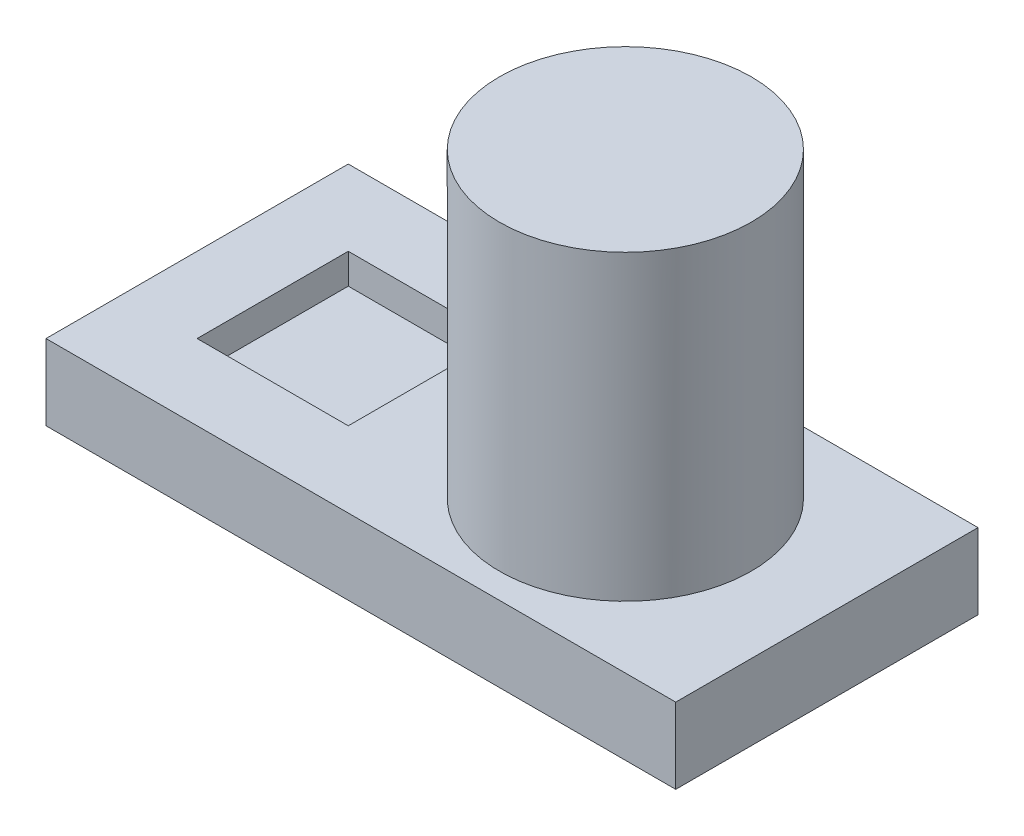
ISO-10303-21;
HEADER;
FILE_DESCRIPTION(('STEP AP214'),'2;1');
FILE_NAME('part.step','',(''),(''),'','','');
FILE_SCHEMA(('AUTOMOTIVE_DESIGN { 1 0 10303 214 1 1 1 1 }'));
ENDSEC;
DATA;
#1=APPLICATION_CONTEXT('core data for automotive mechanical design processes');
#2=APPLICATION_PROTOCOL_DEFINITION('international standard','automotive_design',2000,#1);
#3=PRODUCT_CONTEXT('',#1,'mechanical');
#4=PRODUCT('Part','Part','',(#3));
#5=PRODUCT_RELATED_PRODUCT_CATEGORY('part','',(#4));
#6=PRODUCT_DEFINITION_FORMATION('','',#4);
#7=PRODUCT_DEFINITION_CONTEXT('part definition',#1,'design');
#8=PRODUCT_DEFINITION('design','',#6,#7);
#9=PRODUCT_DEFINITION_SHAPE('','',#8);
#10=(LENGTH_UNIT() NAMED_UNIT(*) SI_UNIT(.MILLI.,.METRE.));
#11=(NAMED_UNIT(*) PLANE_ANGLE_UNIT() SI_UNIT($,.RADIAN.));
#12=(NAMED_UNIT(*) SI_UNIT($,.STERADIAN.) SOLID_ANGLE_UNIT());
#13=UNCERTAINTY_MEASURE_WITH_UNIT(LENGTH_MEASURE(1.E-05),#10,'distance_accuracy_value','');
#14=(GEOMETRIC_REPRESENTATION_CONTEXT(3) GLOBAL_UNCERTAINTY_ASSIGNED_CONTEXT((#13)) GLOBAL_UNIT_ASSIGNED_CONTEXT((#10,
#11,#12)) REPRESENTATION_CONTEXT('',''));
#15=CARTESIAN_POINT('',(0.,0.,0.));
#16=DIRECTION('',(0.,0.,1.));
#17=DIRECTION('',(1.,0.,0.));
#18=AXIS2_PLACEMENT_3D('',#15,#16,#17);
#19=CARTESIAN_POINT('',(0.,15.,-60.));
#20=DIRECTION('',(0.,-1.,0.));
#21=DIRECTION('',(0.,0.,-1.));
#22=AXIS2_PLACEMENT_3D('',#19,#20,#21);
#23=PLANE('',#22);
#24=DIRECTION('',(0.,0.,-1.));
#25=VECTOR('',#24,1.);
#26=CARTESIAN_POINT('',(45.,15.,-45.));
#27=LINE('',#26,#25);
#28=CARTESIAN_POINT('',(45.,15.,-15.));
#29=VERTEX_POINT('',#28);
#30=CARTESIAN_POINT('',(45.,15.,-45.));
#31=VERTEX_POINT('',#30);
#32=EDGE_CURVE('E111',#29,#31,#27,.T.);
#33=ORIENTED_EDGE('',*,*,#32,.F.);
#34=DIRECTION('',(1.,0.,0.));
#35=VECTOR('',#34,1.);
#36=CARTESIAN_POINT('',(15.,15.,-15.));
#37=LINE('',#36,#35);
#38=CARTESIAN_POINT('',(15.,15.,-15.));
#39=VERTEX_POINT('',#38);
#40=EDGE_CURVE('E45',#39,#29,#37,.T.);
#41=ORIENTED_EDGE('',*,*,#40,.F.);
#42=DIRECTION('',(0.,0.,1.));
#43=VECTOR('',#42,1.);
#44=CARTESIAN_POINT('',(15.,15.,-45.));
#45=LINE('',#44,#43);
#46=CARTESIAN_POINT('',(15.,15.,-45.));
#47=VERTEX_POINT('',#46);
#48=EDGE_CURVE('E116',#47,#39,#45,.T.);
#49=ORIENTED_EDGE('',*,*,#48,.F.);
#50=DIRECTION('',(-1.,0.,0.));
#51=VECTOR('',#50,1.);
#52=CARTESIAN_POINT('',(15.,15.,-45.));
#53=LINE('',#52,#51);
#54=EDGE_CURVE('E100',#31,#47,#53,.T.);
#55=ORIENTED_EDGE('',*,*,#54,.F.);
#56=EDGE_LOOP('',(#33,#41,#49,#55));
#57=FACE_BOUND('',#56,.T.);
#58=DIRECTION('',(0.,0.,1.));
#59=VECTOR('',#58,1.);
#60=CARTESIAN_POINT('',(0.,15.,0.));
#61=LINE('',#60,#59);
#62=CARTESIAN_POINT('',(0.,15.,-60.));
#63=VERTEX_POINT('',#62);
#64=CARTESIAN_POINT('',(0.,15.,0.));
#65=VERTEX_POINT('',#64);
#66=EDGE_CURVE('E146',#63,#65,#61,.T.);
#67=ORIENTED_EDGE('',*,*,#66,.T.);
#68=DIRECTION('',(1.,0.,0.));
#69=VECTOR('',#68,1.);
#70=CARTESIAN_POINT('',(0.,15.,0.));
#71=LINE('',#70,#69);
#72=CARTESIAN_POINT('',(125.,15.,0.));
#73=VERTEX_POINT('',#72);
#74=EDGE_CURVE('E148',#65,#73,#71,.T.);
#75=ORIENTED_EDGE('',*,*,#74,.T.);
#76=DIRECTION('',(0.,0.,-1.));
#77=VECTOR('',#76,1.);
#78=CARTESIAN_POINT('',(125.,15.,0.));
#79=LINE('',#78,#77);
#80=CARTESIAN_POINT('',(125.,15.,-60.));
#81=VERTEX_POINT('',#80);
#82=EDGE_CURVE('E150',#73,#81,#79,.T.);
#83=ORIENTED_EDGE('',*,*,#82,.T.);
#84=DIRECTION('',(-1.,0.,0.));
#85=VECTOR('',#84,1.);
#86=CARTESIAN_POINT('',(0.,15.,-60.));
#87=LINE('',#86,#85);
#88=EDGE_CURVE('E53',#81,#63,#87,.T.);
#89=ORIENTED_EDGE('',*,*,#88,.T.);
#90=EDGE_LOOP('',(#67,#75,#83,#89));
#91=FACE_BOUND('',#90,.T.);
#92=CARTESIAN_POINT('',(85.,15.,-30.));
#93=DIRECTION('',(0.,-1.,0.));
#94=DIRECTION('',(0.,0.,-1.));
#95=AXIS2_PLACEMENT_3D('',#92,#93,#94);
#96=CIRCLE('',#95,25.);
#97=CARTESIAN_POINT('',(85.,15.,-55.));
#98=VERTEX_POINT('',#97);
#99=EDGE_CURVE('E11',#98,#98,#96,.F.);
#100=ORIENTED_EDGE('',*,*,#99,.F.);
#101=EDGE_LOOP('',(#100));
#102=FACE_BOUND('',#101,.T.);
#103=ADVANCED_FACE('F30',(#57,#91,#102),#23,.F.);
#104=CARTESIAN_POINT('',(0.,15.,0.));
#105=DIRECTION('',(1.,0.,0.));
#106=DIRECTION('',(0.,0.,-1.));
#107=AXIS2_PLACEMENT_3D('',#104,#105,#106);
#108=PLANE('',#107);
#109=DIRECTION('',(0.,0.,1.));
#110=VECTOR('',#109,1.);
#111=CARTESIAN_POINT('',(0.,0.,0.));
#112=LINE('',#111,#110);
#113=CARTESIAN_POINT('',(0.,0.,-60.));
#114=VERTEX_POINT('',#113);
#115=CARTESIAN_POINT('',(0.,0.,0.));
#116=VERTEX_POINT('',#115);
#117=EDGE_CURVE('E137',#114,#116,#112,.T.);
#118=ORIENTED_EDGE('',*,*,#117,.T.);
#119=DIRECTION('',(0.,-1.,0.));
#120=VECTOR('',#119,1.);
#121=CARTESIAN_POINT('',(0.,15.,0.));
#122=LINE('',#121,#120);
#123=EDGE_CURVE('E38',#65,#116,#122,.T.);
#124=ORIENTED_EDGE('',*,*,#123,.F.);
#125=ORIENTED_EDGE('',*,*,#66,.F.);
#126=DIRECTION('',(0.,-1.,0.));
#127=VECTOR('',#126,1.);
#128=CARTESIAN_POINT('',(0.,15.,-60.));
#129=LINE('',#128,#127);
#130=EDGE_CURVE('E153',#63,#114,#129,.T.);
#131=ORIENTED_EDGE('',*,*,#130,.T.);
#132=EDGE_LOOP('',(#118,#124,#125,#131));
#133=FACE_BOUND('',#132,.T.);
#134=ADVANCED_FACE('F32',(#133),#108,.F.);
#135=CARTESIAN_POINT('',(0.,15.,0.));
#136=DIRECTION('',(0.,0.,-1.));
#137=DIRECTION('',(-1.,0.,0.));
#138=AXIS2_PLACEMENT_3D('',#135,#136,#137);
#139=PLANE('',#138);
#140=DIRECTION('',(1.,0.,0.));
#141=VECTOR('',#140,1.);
#142=CARTESIAN_POINT('',(0.,0.,0.));
#143=LINE('',#142,#141);
#144=CARTESIAN_POINT('',(125.,0.,0.));
#145=VERTEX_POINT('',#144);
#146=EDGE_CURVE('E140',#116,#145,#143,.T.);
#147=ORIENTED_EDGE('',*,*,#146,.T.);
#148=DIRECTION('',(0.,-1.,0.));
#149=VECTOR('',#148,1.);
#150=CARTESIAN_POINT('',(125.,15.,0.));
#151=LINE('',#150,#149);
#152=EDGE_CURVE('E159',#73,#145,#151,.T.);
#153=ORIENTED_EDGE('',*,*,#152,.F.);
#154=ORIENTED_EDGE('',*,*,#74,.F.);
#155=ORIENTED_EDGE('',*,*,#123,.T.);
#156=EDGE_LOOP('',(#147,#153,#154,#155));
#157=FACE_BOUND('',#156,.T.);
#158=ADVANCED_FACE('F164',(#157),#139,.F.);
#159=CARTESIAN_POINT('',(125.,15.,0.));
#160=DIRECTION('',(-1.,0.,0.));
#161=DIRECTION('',(0.,0.,1.));
#162=AXIS2_PLACEMENT_3D('',#159,#160,#161);
#163=PLANE('',#162);
#164=DIRECTION('',(0.,0.,-1.));
#165=VECTOR('',#164,1.);
#166=CARTESIAN_POINT('',(125.,0.,0.));
#167=LINE('',#166,#165);
#168=CARTESIAN_POINT('',(125.,0.,-60.));
#169=VERTEX_POINT('',#168);
#170=EDGE_CURVE('E142',#145,#169,#167,.T.);
#171=ORIENTED_EDGE('',*,*,#170,.T.);
#172=DIRECTION('',(0.,-1.,0.));
#173=VECTOR('',#172,1.);
#174=CARTESIAN_POINT('',(125.,15.,-60.));
#175=LINE('',#174,#173);
#176=EDGE_CURVE('E156',#81,#169,#175,.T.);
#177=ORIENTED_EDGE('',*,*,#176,.F.);
#178=ORIENTED_EDGE('',*,*,#82,.F.);
#179=ORIENTED_EDGE('',*,*,#152,.T.);
#180=EDGE_LOOP('',(#171,#177,#178,#179));
#181=FACE_BOUND('',#180,.T.);
#182=ADVANCED_FACE('F175',(#181),#163,.F.);
#183=CARTESIAN_POINT('',(0.,15.,-60.));
#184=DIRECTION('',(0.,0.,1.));
#185=DIRECTION('',(1.,0.,0.));
#186=AXIS2_PLACEMENT_3D('',#183,#184,#185);
#187=PLANE('',#186);
#188=DIRECTION('',(-1.,0.,0.));
#189=VECTOR('',#188,1.);
#190=CARTESIAN_POINT('',(0.,0.,-60.));
#191=LINE('',#190,#189);
#192=EDGE_CURVE('E144',#169,#114,#191,.T.);
#193=ORIENTED_EDGE('',*,*,#192,.T.);
#194=ORIENTED_EDGE('',*,*,#130,.F.);
#195=ORIENTED_EDGE('',*,*,#88,.F.);
#196=ORIENTED_EDGE('',*,*,#176,.T.);
#197=EDGE_LOOP('',(#193,#194,#195,#196));
#198=FACE_BOUND('',#197,.T.);
#199=ADVANCED_FACE('F178',(#198),#187,.F.);
#200=CARTESIAN_POINT('',(0.,0.,-60.));
#201=DIRECTION('',(0.,-1.,0.));
#202=DIRECTION('',(0.,0.,-1.));
#203=AXIS2_PLACEMENT_3D('',#200,#201,#202);
#204=PLANE('',#203);
#205=ORIENTED_EDGE('',*,*,#117,.F.);
#206=ORIENTED_EDGE('',*,*,#192,.F.);
#207=ORIENTED_EDGE('',*,*,#170,.F.);
#208=ORIENTED_EDGE('',*,*,#146,.F.);
#209=EDGE_LOOP('',(#205,#206,#207,#208));
#210=FACE_BOUND('',#209,.T.);
#211=ADVANCED_FACE('F171',(#210),#204,.T.);
#212=CARTESIAN_POINT('',(85.,75.,-30.));
#213=DIRECTION('',(0.,-1.,0.));
#214=DIRECTION('',(0.,0.,-1.));
#215=AXIS2_PLACEMENT_3D('',#212,#213,#214);
#216=CYLINDRICAL_SURFACE('',#215,25.);
#217=CARTESIAN_POINT('',(85.,75.,-30.));
#218=DIRECTION('',(0.,1.,0.));
#219=DIRECTION('',(0.,0.,1.));
#220=AXIS2_PLACEMENT_3D('',#217,#218,#219);
#221=CIRCLE('',#220,25.);
#222=CARTESIAN_POINT('',(85.,75.,-4.99999999999999));
#223=VERTEX_POINT('',#222);
#224=EDGE_CURVE('E132',#223,#223,#221,.T.);
#225=ORIENTED_EDGE('',*,*,#224,.F.);
#226=EDGE_LOOP('',(#225));
#227=FACE_BOUND('',#226,.T.);
#228=ORIENTED_EDGE('',*,*,#99,.T.);
#229=EDGE_LOOP('',(#228));
#230=FACE_BOUND('',#229,.T.);
#231=ADVANCED_FACE('F184',(#227,#230),#216,.T.);
#232=CARTESIAN_POINT('',(85.,75.,-30.));
#233=DIRECTION('',(0.,1.,0.));
#234=DIRECTION('',(0.,0.,1.));
#235=AXIS2_PLACEMENT_3D('',#232,#233,#234);
#236=PLANE('',#235);
#237=ORIENTED_EDGE('',*,*,#224,.T.);
#238=EDGE_LOOP('',(#237));
#239=FACE_BOUND('',#238,.T.);
#240=ADVANCED_FACE('F186',(#239),#236,.T.);
#241=CARTESIAN_POINT('',(15.,9.,-15.));
#242=DIRECTION('',(0.,0.,1.));
#243=DIRECTION('',(1.,0.,0.));
#244=AXIS2_PLACEMENT_3D('',#241,#242,#243);
#245=PLANE('',#244);
#246=ORIENTED_EDGE('',*,*,#40,.T.);
#247=DIRECTION('',(0.,1.,0.));
#248=VECTOR('',#247,1.);
#249=CARTESIAN_POINT('',(45.,9.,-15.));
#250=LINE('',#249,#248);
#251=CARTESIAN_POINT('',(45.,9.,-15.));
#252=VERTEX_POINT('',#251);
#253=EDGE_CURVE('E108',#252,#29,#250,.T.);
#254=ORIENTED_EDGE('',*,*,#253,.F.);
#255=DIRECTION('',(1.,0.,0.));
#256=VECTOR('',#255,1.);
#257=CARTESIAN_POINT('',(15.,9.,-15.));
#258=LINE('',#257,#256);
#259=CARTESIAN_POINT('',(15.,9.,-15.));
#260=VERTEX_POINT('',#259);
#261=EDGE_CURVE('E118',#260,#252,#258,.T.);
#262=ORIENTED_EDGE('',*,*,#261,.F.);
#263=DIRECTION('',(0.,1.,0.));
#264=VECTOR('',#263,1.);
#265=CARTESIAN_POINT('',(15.,9.,-15.));
#266=LINE('',#265,#264);
#267=EDGE_CURVE('E130',#260,#39,#266,.T.);
#268=ORIENTED_EDGE('',*,*,#267,.T.);
#269=EDGE_LOOP('',(#246,#254,#262,#268));
#270=FACE_BOUND('',#269,.T.);
#271=ADVANCED_FACE('F193',(#270),#245,.F.);
#272=CARTESIAN_POINT('',(15.,9.,-45.));
#273=DIRECTION('',(-1.,0.,0.));
#274=DIRECTION('',(0.,0.,1.));
#275=AXIS2_PLACEMENT_3D('',#272,#273,#274);
#276=PLANE('',#275);
#277=ORIENTED_EDGE('',*,*,#48,.T.);
#278=ORIENTED_EDGE('',*,*,#267,.F.);
#279=DIRECTION('',(0.,0.,1.));
#280=VECTOR('',#279,1.);
#281=CARTESIAN_POINT('',(15.,9.,-45.));
#282=LINE('',#281,#280);
#283=CARTESIAN_POINT('',(15.,9.,-45.));
#284=VERTEX_POINT('',#283);
#285=EDGE_CURVE('E127',#284,#260,#282,.T.);
#286=ORIENTED_EDGE('',*,*,#285,.F.);
#287=DIRECTION('',(0.,1.,0.));
#288=VECTOR('',#287,1.);
#289=CARTESIAN_POINT('',(15.,9.,-45.));
#290=LINE('',#289,#288);
#291=EDGE_CURVE('E107',#284,#47,#290,.T.);
#292=ORIENTED_EDGE('',*,*,#291,.T.);
#293=EDGE_LOOP('',(#277,#278,#286,#292));
#294=FACE_BOUND('',#293,.T.);
#295=ADVANCED_FACE('F227',(#294),#276,.F.);
#296=CARTESIAN_POINT('',(15.,9.,-45.));
#297=DIRECTION('',(0.,0.,-1.));
#298=DIRECTION('',(-1.,0.,0.));
#299=AXIS2_PLACEMENT_3D('',#296,#297,#298);
#300=PLANE('',#299);
#301=ORIENTED_EDGE('',*,*,#54,.T.);
#302=ORIENTED_EDGE('',*,*,#291,.F.);
#303=DIRECTION('',(-1.,0.,0.));
#304=VECTOR('',#303,1.);
#305=CARTESIAN_POINT('',(15.,9.,-45.));
#306=LINE('',#305,#304);
#307=CARTESIAN_POINT('',(45.,9.,-45.));
#308=VERTEX_POINT('',#307);
#309=EDGE_CURVE('E103',#308,#284,#306,.T.);
#310=ORIENTED_EDGE('',*,*,#309,.F.);
#311=DIRECTION('',(0.,1.,0.));
#312=VECTOR('',#311,1.);
#313=CARTESIAN_POINT('',(45.,9.,-45.));
#314=LINE('',#313,#312);
#315=EDGE_CURVE('E96',#308,#31,#314,.T.);
#316=ORIENTED_EDGE('',*,*,#315,.T.);
#317=EDGE_LOOP('',(#301,#302,#310,#316));
#318=FACE_BOUND('',#317,.T.);
#319=ADVANCED_FACE('F98',(#318),#300,.F.);
#320=CARTESIAN_POINT('',(45.,9.,-45.));
#321=DIRECTION('',(1.,0.,0.));
#322=DIRECTION('',(0.,0.,-1.));
#323=AXIS2_PLACEMENT_3D('',#320,#321,#322);
#324=PLANE('',#323);
#325=ORIENTED_EDGE('',*,*,#32,.T.);
#326=ORIENTED_EDGE('',*,*,#315,.F.);
#327=DIRECTION('',(0.,0.,-1.));
#328=VECTOR('',#327,1.);
#329=CARTESIAN_POINT('',(45.,9.,-45.));
#330=LINE('',#329,#328);
#331=EDGE_CURVE('E124',#252,#308,#330,.T.);
#332=ORIENTED_EDGE('',*,*,#331,.F.);
#333=ORIENTED_EDGE('',*,*,#253,.T.);
#334=EDGE_LOOP('',(#325,#326,#332,#333));
#335=FACE_BOUND('',#334,.T.);
#336=ADVANCED_FACE('F112',(#335),#324,.F.);
#337=CARTESIAN_POINT('',(45.,9.,-15.));
#338=DIRECTION('',(0.,-1.,0.));
#339=DIRECTION('',(0.,0.,-1.));
#340=AXIS2_PLACEMENT_3D('',#337,#338,#339);
#341=PLANE('',#340);
#342=ORIENTED_EDGE('',*,*,#261,.T.);
#343=ORIENTED_EDGE('',*,*,#331,.T.);
#344=ORIENTED_EDGE('',*,*,#309,.T.);
#345=ORIENTED_EDGE('',*,*,#285,.T.);
#346=EDGE_LOOP('',(#342,#343,#344,#345));
#347=FACE_BOUND('',#346,.T.);
#348=ADVANCED_FACE('F252',(#347),#341,.F.);
#349=CLOSED_SHELL('',(#103,#134,#158,#182,#199,#211,#231,#240,#271,#295,#319,#336,#348));
#350=MANIFOLD_SOLID_BREP('B2',#349);
#351=ADVANCED_BREP_SHAPE_REPRESENTATION('',(#18,#350),#14);
#352=SHAPE_DEFINITION_REPRESENTATION(#9,#351);
ENDSEC;
END-ISO-10303-21;
